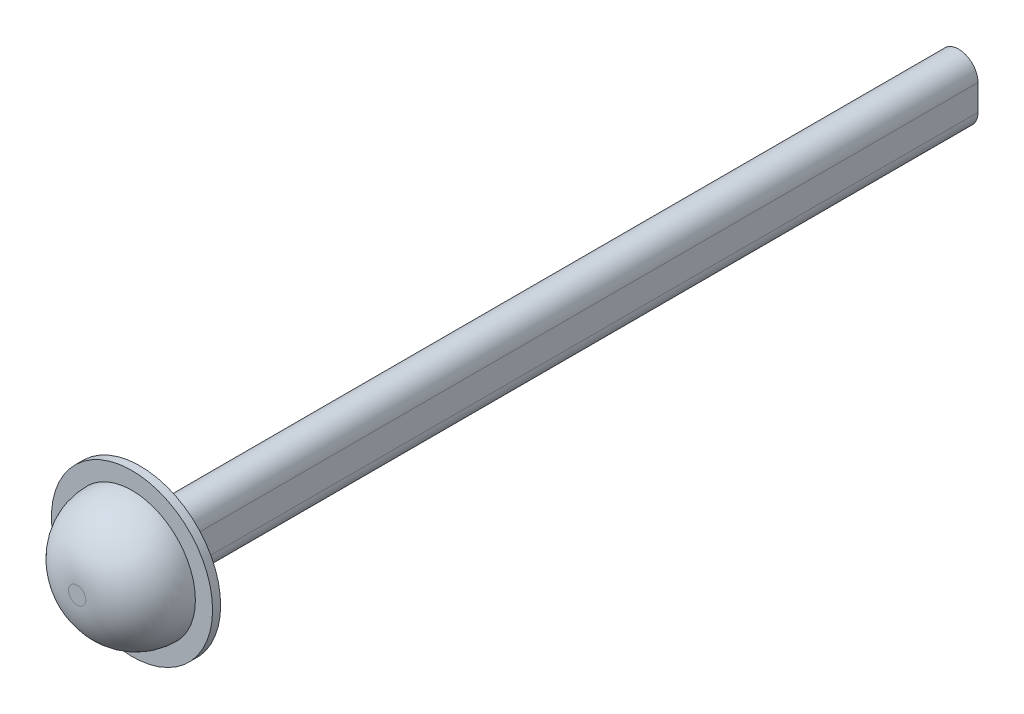
ISO-10303-21;
HEADER;
FILE_DESCRIPTION(('STEP AP214'),'2;1');
FILE_NAME('part.step','',(''),(''),'','','');
FILE_SCHEMA(('AUTOMOTIVE_DESIGN { 1 0 10303 214 1 1 1 1 }'));
ENDSEC;
DATA;
#1=APPLICATION_CONTEXT('core data for automotive mechanical design processes');
#2=APPLICATION_PROTOCOL_DEFINITION('international standard','automotive_design',2000,#1);
#3=PRODUCT_CONTEXT('',#1,'mechanical');
#4=PRODUCT('Part','Part','',(#3));
#5=PRODUCT_RELATED_PRODUCT_CATEGORY('part','',(#4));
#6=PRODUCT_DEFINITION_FORMATION('','',#4);
#7=PRODUCT_DEFINITION_CONTEXT('part definition',#1,'design');
#8=PRODUCT_DEFINITION('design','',#6,#7);
#9=PRODUCT_DEFINITION_SHAPE('','',#8);
#10=(LENGTH_UNIT() NAMED_UNIT(*) SI_UNIT(.MILLI.,.METRE.));
#11=(NAMED_UNIT(*) PLANE_ANGLE_UNIT() SI_UNIT($,.RADIAN.));
#12=(NAMED_UNIT(*) SI_UNIT($,.STERADIAN.) SOLID_ANGLE_UNIT());
#13=UNCERTAINTY_MEASURE_WITH_UNIT(LENGTH_MEASURE(1.E-05),#10,'distance_accuracy_value','');
#14=(GEOMETRIC_REPRESENTATION_CONTEXT(3) GLOBAL_UNCERTAINTY_ASSIGNED_CONTEXT((#13)) GLOBAL_UNIT_ASSIGNED_CONTEXT((#10,
#11,#12)) REPRESENTATION_CONTEXT('',''));
#15=CARTESIAN_POINT('',(0.,0.,0.));
#16=DIRECTION('',(0.,0.,1.));
#17=DIRECTION('',(1.,0.,0.));
#18=AXIS2_PLACEMENT_3D('',#15,#16,#17);
#19=CARTESIAN_POINT('',(0.,4.,254.));
#20=DIRECTION('',(0.,0.,-1.));
#21=DIRECTION('',(-1.,0.,0.));
#22=AXIS2_PLACEMENT_3D('',#19,#20,#21);
#23=CYLINDRICAL_SURFACE('',#22,6.);
#24=DIRECTION('',(0.,0.,-1.));
#25=VECTOR('',#24,1.);
#26=CARTESIAN_POINT('',(-6.,4.,254.));
#27=LINE('',#26,#25);
#28=CARTESIAN_POINT('',(-6.,4.,251.));
#29=VERTEX_POINT('',#28);
#30=CARTESIAN_POINT('',(-6.,4.,0.));
#31=VERTEX_POINT('',#30);
#32=EDGE_CURVE('E91',#29,#31,#27,.T.);
#33=ORIENTED_EDGE('',*,*,#32,.F.);
#34=CARTESIAN_POINT('',(0.,4.,251.));
#35=DIRECTION('',(0.,0.,1.));
#36=DIRECTION('',(1.,0.,0.));
#37=AXIS2_PLACEMENT_3D('',#34,#35,#36);
#38=CIRCLE('',#37,6.);
#39=CARTESIAN_POINT('',(6.,4.,251.));
#40=VERTEX_POINT('',#39);
#41=EDGE_CURVE('E138',#29,#40,#38,.F.);
#42=ORIENTED_EDGE('',*,*,#41,.T.);
#43=DIRECTION('',(0.,0.,-1.));
#44=VECTOR('',#43,1.);
#45=CARTESIAN_POINT('',(6.,4.,254.));
#46=LINE('',#45,#44);
#47=CARTESIAN_POINT('',(6.,4.,0.));
#48=VERTEX_POINT('',#47);
#49=EDGE_CURVE('E111',#40,#48,#46,.T.);
#50=ORIENTED_EDGE('',*,*,#49,.T.);
#51=CARTESIAN_POINT('',(0.,4.,0.));
#52=DIRECTION('',(0.,0.,1.));
#53=DIRECTION('',(1.,0.,0.));
#54=AXIS2_PLACEMENT_3D('',#51,#52,#53);
#55=CIRCLE('',#54,6.);
#56=EDGE_CURVE('E106',#48,#31,#55,.T.);
#57=ORIENTED_EDGE('',*,*,#56,.T.);
#58=EDGE_LOOP('',(#33,#42,#50,#57));
#59=FACE_BOUND('',#58,.T.);
#60=ADVANCED_FACE('F39',(#59),#23,.T.);
#61=CARTESIAN_POINT('',(-6.,4.,254.));
#62=DIRECTION('',(1.,0.,0.));
#63=DIRECTION('',(0.,1.,0.));
#64=AXIS2_PLACEMENT_3D('',#61,#62,#63);
#65=PLANE('',#64);
#66=DIRECTION('',(0.,0.,-1.));
#67=VECTOR('',#66,1.);
#68=CARTESIAN_POINT('',(-6.,-4.,254.));
#69=LINE('',#68,#67);
#70=CARTESIAN_POINT('',(-6.,-4.,251.));
#71=VERTEX_POINT('',#70);
#72=CARTESIAN_POINT('',(-6.,-4.,0.));
#73=VERTEX_POINT('',#72);
#74=EDGE_CURVE('E100',#71,#73,#69,.T.);
#75=ORIENTED_EDGE('',*,*,#74,.F.);
#76=DIRECTION('',(0.,1.,0.));
#77=VECTOR('',#76,1.);
#78=CARTESIAN_POINT('',(-6.,4.,251.));
#79=LINE('',#78,#77);
#80=EDGE_CURVE('E48',#71,#29,#79,.T.);
#81=ORIENTED_EDGE('',*,*,#80,.T.);
#82=ORIENTED_EDGE('',*,*,#32,.T.);
#83=DIRECTION('',(0.,-1.,0.));
#84=VECTOR('',#83,1.);
#85=CARTESIAN_POINT('',(-6.,4.,0.));
#86=LINE('',#85,#84);
#87=EDGE_CURVE('E94',#31,#73,#86,.T.);
#88=ORIENTED_EDGE('',*,*,#87,.T.);
#89=EDGE_LOOP('',(#75,#81,#82,#88));
#90=FACE_BOUND('',#89,.T.);
#91=ADVANCED_FACE('F93',(#90),#65,.F.);
#92=CARTESIAN_POINT('',(0.,-4.,254.));
#93=DIRECTION('',(0.,0.,-1.));
#94=DIRECTION('',(-1.,0.,0.));
#95=AXIS2_PLACEMENT_3D('',#92,#93,#94);
#96=CYLINDRICAL_SURFACE('',#95,6.);
#97=DIRECTION('',(0.,0.,-1.));
#98=VECTOR('',#97,1.);
#99=CARTESIAN_POINT('',(6.,-4.,254.));
#100=LINE('',#99,#98);
#101=CARTESIAN_POINT('',(6.,-4.,251.));
#102=VERTEX_POINT('',#101);
#103=CARTESIAN_POINT('',(6.,-4.,0.));
#104=VERTEX_POINT('',#103);
#105=EDGE_CURVE('E124',#102,#104,#100,.T.);
#106=ORIENTED_EDGE('',*,*,#105,.F.);
#107=CARTESIAN_POINT('',(0.,-4.,251.));
#108=DIRECTION('',(0.,0.,1.));
#109=DIRECTION('',(1.,0.,0.));
#110=AXIS2_PLACEMENT_3D('',#107,#108,#109);
#111=CIRCLE('',#110,6.);
#112=EDGE_CURVE('E55',#102,#71,#111,.F.);
#113=ORIENTED_EDGE('',*,*,#112,.T.);
#114=ORIENTED_EDGE('',*,*,#74,.T.);
#115=CARTESIAN_POINT('',(0.,-4.,0.));
#116=DIRECTION('',(0.,0.,1.));
#117=DIRECTION('',(1.,0.,0.));
#118=AXIS2_PLACEMENT_3D('',#115,#116,#117);
#119=CIRCLE('',#118,6.);
#120=EDGE_CURVE('E108',#73,#104,#119,.T.);
#121=ORIENTED_EDGE('',*,*,#120,.T.);
#122=EDGE_LOOP('',(#106,#113,#114,#121));
#123=FACE_BOUND('',#122,.T.);
#124=ADVANCED_FACE('F178',(#123),#96,.T.);
#125=CARTESIAN_POINT('',(6.,4.,254.));
#126=DIRECTION('',(-1.,0.,0.));
#127=DIRECTION('',(0.,0.,1.));
#128=AXIS2_PLACEMENT_3D('',#125,#126,#127);
#129=PLANE('',#128);
#130=ORIENTED_EDGE('',*,*,#49,.F.);
#131=DIRECTION('',(0.,-1.,0.));
#132=VECTOR('',#131,1.);
#133=CARTESIAN_POINT('',(6.,-4.,251.));
#134=LINE('',#133,#132);
#135=EDGE_CURVE('E135',#40,#102,#134,.T.);
#136=ORIENTED_EDGE('',*,*,#135,.T.);
#137=ORIENTED_EDGE('',*,*,#105,.T.);
#138=DIRECTION('',(0.,1.,0.));
#139=VECTOR('',#138,1.);
#140=CARTESIAN_POINT('',(6.,4.,0.));
#141=LINE('',#140,#139);
#142=EDGE_CURVE('E121',#104,#48,#141,.T.);
#143=ORIENTED_EDGE('',*,*,#142,.T.);
#144=EDGE_LOOP('',(#130,#136,#137,#143));
#145=FACE_BOUND('',#144,.T.);
#146=ADVANCED_FACE('F170',(#145),#129,.F.);
#147=CARTESIAN_POINT('',(0.,4.,0.));
#148=DIRECTION('',(0.,0.,1.));
#149=DIRECTION('',(1.,0.,0.));
#150=AXIS2_PLACEMENT_3D('',#147,#148,#149);
#151=PLANE('',#150);
#152=ORIENTED_EDGE('',*,*,#56,.F.);
#153=ORIENTED_EDGE('',*,*,#142,.F.);
#154=ORIENTED_EDGE('',*,*,#120,.F.);
#155=ORIENTED_EDGE('',*,*,#87,.F.);
#156=EDGE_LOOP('',(#152,#153,#154,#155));
#157=FACE_BOUND('',#156,.T.);
#158=ADVANCED_FACE('F104',(#157),#151,.F.);
#159=CARTESIAN_POINT('',(0.,0.,254.));
#160=DIRECTION('',(0.,0.,1.));
#161=DIRECTION('',(1.,0.,0.));
#162=AXIS2_PLACEMENT_3D('',#159,#160,#161);
#163=PLANE('',#162);
#164=CARTESIAN_POINT('',(0.,-4.,254.));
#165=DIRECTION('',(0.,0.,1.));
#166=DIRECTION('',(1.,0.,0.));
#167=AXIS2_PLACEMENT_3D('',#164,#165,#166);
#168=CIRCLE('',#167,9.00000000000001);
#169=CARTESIAN_POINT('',(-9.00000000000001,-4.,254.));
#170=VERTEX_POINT('',#169);
#171=CARTESIAN_POINT('',(9.00000000000001,-4.,254.));
#172=VERTEX_POINT('',#171);
#173=EDGE_CURVE('E128',#170,#172,#168,.T.);
#174=ORIENTED_EDGE('',*,*,#173,.T.);
#175=DIRECTION('',(0.,1.,0.));
#176=VECTOR('',#175,1.);
#177=CARTESIAN_POINT('',(9.00000000000001,4.,254.));
#178=LINE('',#177,#176);
#179=CARTESIAN_POINT('',(9.00000000000001,4.,254.));
#180=VERTEX_POINT('',#179);
#181=EDGE_CURVE('E132',#172,#180,#178,.T.);
#182=ORIENTED_EDGE('',*,*,#181,.T.);
#183=CARTESIAN_POINT('',(0.,4.,254.));
#184=DIRECTION('',(0.,0.,1.));
#185=DIRECTION('',(1.,0.,0.));
#186=AXIS2_PLACEMENT_3D('',#183,#184,#185);
#187=CIRCLE('',#186,9.00000000000001);
#188=CARTESIAN_POINT('',(-9.00000000000001,4.,254.));
#189=VERTEX_POINT('',#188);
#190=EDGE_CURVE('E130',#180,#189,#187,.T.);
#191=ORIENTED_EDGE('',*,*,#190,.T.);
#192=DIRECTION('',(0.,-1.,0.));
#193=VECTOR('',#192,1.);
#194=CARTESIAN_POINT('',(-9.00000000000001,-4.,254.));
#195=LINE('',#194,#193);
#196=EDGE_CURVE('E99',#189,#170,#195,.T.);
#197=ORIENTED_EDGE('',*,*,#196,.T.);
#198=EDGE_LOOP('',(#174,#182,#191,#197));
#199=FACE_BOUND('',#198,.T.);
#200=CARTESIAN_POINT('',(0.,0.,254.));
#201=DIRECTION('',(0.,0.,1.));
#202=DIRECTION('',(1.,0.,0.));
#203=AXIS2_PLACEMENT_3D('',#200,#201,#202);
#204=CIRCLE('',#203,25.);
#205=CARTESIAN_POINT('',(25.,0.,254.));
#206=VERTEX_POINT('',#205);
#207=EDGE_CURVE('E116',#206,#206,#204,.T.);
#208=ORIENTED_EDGE('',*,*,#207,.F.);
#209=EDGE_LOOP('',(#208));
#210=FACE_BOUND('',#209,.T.);
#211=ADVANCED_FACE('F159',(#199,#210),#163,.F.);
#212=CARTESIAN_POINT('',(0.,0.,256.5));
#213=DIRECTION('',(0.,0.,-1.));
#214=DIRECTION('',(-1.,0.,0.));
#215=AXIS2_PLACEMENT_3D('',#212,#213,#214);
#216=CYLINDRICAL_SURFACE('',#215,25.);
#217=CARTESIAN_POINT('',(0.,0.,256.5));
#218=DIRECTION('',(0.,0.,1.));
#219=DIRECTION('',(1.,0.,0.));
#220=AXIS2_PLACEMENT_3D('',#217,#218,#219);
#221=CIRCLE('',#220,25.);
#222=CARTESIAN_POINT('',(25.,0.,256.5));
#223=VERTEX_POINT('',#222);
#224=EDGE_CURVE('E113',#223,#223,#221,.T.);
#225=ORIENTED_EDGE('',*,*,#224,.F.);
#226=EDGE_LOOP('',(#225));
#227=FACE_BOUND('',#226,.T.);
#228=ORIENTED_EDGE('',*,*,#207,.T.);
#229=EDGE_LOOP('',(#228));
#230=FACE_BOUND('',#229,.T.);
#231=ADVANCED_FACE('F157',(#227,#230),#216,.T.);
#232=CARTESIAN_POINT('',(0.,0.,256.5));
#233=DIRECTION('',(0.,0.,1.));
#234=DIRECTION('',(1.,0.,0.));
#235=AXIS2_PLACEMENT_3D('',#232,#233,#234);
#236=PLANE('',#235);
#237=CARTESIAN_POINT('',(0.,0.,256.5));
#238=DIRECTION('',(0.,0.,1.));
#239=DIRECTION('',(1.,0.,0.));
#240=AXIS2_PLACEMENT_3D('',#237,#238,#239);
#241=CIRCLE('',#240,19.6696403864003);
#242=CARTESIAN_POINT('',(19.6696403864003,0.,256.5));
#243=VERTEX_POINT('',#242);
#244=EDGE_CURVE('E11',#243,#243,#241,.T.);
#245=ORIENTED_EDGE('',*,*,#244,.F.);
#246=EDGE_LOOP('',(#245));
#247=FACE_BOUND('',#246,.T.);
#248=ORIENTED_EDGE('',*,*,#224,.T.);
#249=EDGE_LOOP('',(#248));
#250=FACE_BOUND('',#249,.T.);
#251=ADVANCED_FACE('F167',(#247,#250),#236,.T.);
#252=CARTESIAN_POINT('',(-9.00000000000001,0.,254.));
#253=DIRECTION('',(-0.707106781186547,0.,-0.707106781186548));
#254=DIRECTION('',(0.,1.,0.));
#255=AXIS2_PLACEMENT_3D('',#252,#253,#254);
#256=PLANE('',#255);
#257=DIRECTION('',(-0.707106781186548,0.,0.707106781186547));
#258=VECTOR('',#257,1.);
#259=CARTESIAN_POINT('',(-6.,4.,251.));
#260=LINE('',#259,#258);
#261=EDGE_CURVE('E147',#29,#189,#260,.T.);
#262=ORIENTED_EDGE('',*,*,#261,.F.);
#263=ORIENTED_EDGE('',*,*,#80,.F.);
#264=DIRECTION('',(0.707106781186548,0.,-0.707106781186547));
#265=VECTOR('',#264,1.);
#266=CARTESIAN_POINT('',(-9.00000000000001,-4.,254.));
#267=LINE('',#266,#265);
#268=EDGE_CURVE('E149',#170,#71,#267,.T.);
#269=ORIENTED_EDGE('',*,*,#268,.F.);
#270=ORIENTED_EDGE('',*,*,#196,.F.);
#271=EDGE_LOOP('',(#262,#263,#269,#270));
#272=FACE_BOUND('',#271,.T.);
#273=ADVANCED_FACE('F42',(#272),#256,.T.);
#274=CARTESIAN_POINT('',(0.,-4.,254.));
#275=DIRECTION('',(0.,0.,1.));
#276=DIRECTION('',(1.,0.,0.));
#277=AXIS2_PLACEMENT_3D('',#274,#275,#276);
#278=CONICAL_SURFACE('',#277,9.00000000000001,0.785398163397449);
#279=ORIENTED_EDGE('',*,*,#268,.T.);
#280=ORIENTED_EDGE('',*,*,#112,.F.);
#281=DIRECTION('',(-0.707106781186548,0.,-0.707106781186547));
#282=VECTOR('',#281,1.);
#283=CARTESIAN_POINT('',(9.00000000000001,-4.,254.));
#284=LINE('',#283,#282);
#285=EDGE_CURVE('E144',#172,#102,#284,.T.);
#286=ORIENTED_EDGE('',*,*,#285,.F.);
#287=ORIENTED_EDGE('',*,*,#173,.F.);
#288=EDGE_LOOP('',(#279,#280,#286,#287));
#289=FACE_BOUND('',#288,.T.);
#290=ADVANCED_FACE('F196',(#289),#278,.T.);
#291=CARTESIAN_POINT('',(0.,4.,254.));
#292=DIRECTION('',(0.,0.,1.));
#293=DIRECTION('',(1.,0.,0.));
#294=AXIS2_PLACEMENT_3D('',#291,#292,#293);
#295=CONICAL_SURFACE('',#294,9.00000000000001,0.785398163397449);
#296=ORIENTED_EDGE('',*,*,#261,.T.);
#297=ORIENTED_EDGE('',*,*,#190,.F.);
#298=DIRECTION('',(0.707106781186548,0.,0.707106781186547));
#299=VECTOR('',#298,1.);
#300=CARTESIAN_POINT('',(6.,4.,251.));
#301=LINE('',#300,#299);
#302=EDGE_CURVE('E142',#40,#180,#301,.T.);
#303=ORIENTED_EDGE('',*,*,#302,.F.);
#304=ORIENTED_EDGE('',*,*,#41,.F.);
#305=EDGE_LOOP('',(#296,#297,#303,#304));
#306=FACE_BOUND('',#305,.T.);
#307=ADVANCED_FACE('F190',(#306),#295,.T.);
#308=CARTESIAN_POINT('',(9.00000000000001,0.,254.));
#309=DIRECTION('',(0.707106781186547,0.,-0.707106781186548));
#310=DIRECTION('',(0.,-1.,0.));
#311=AXIS2_PLACEMENT_3D('',#308,#309,#310);
#312=PLANE('',#311);
#313=ORIENTED_EDGE('',*,*,#285,.T.);
#314=ORIENTED_EDGE('',*,*,#135,.F.);
#315=ORIENTED_EDGE('',*,*,#302,.T.);
#316=ORIENTED_EDGE('',*,*,#181,.F.);
#317=EDGE_LOOP('',(#313,#314,#315,#316));
#318=FACE_BOUND('',#317,.T.);
#319=ADVANCED_FACE('F183',(#318),#312,.T.);
#320=CARTESIAN_POINT('',(0.,0.,256.5));
#321=DIRECTION('',(0.,0.,1.));
#322=DIRECTION('',(1.,0.,0.));
#323=AXIS2_PLACEMENT_3D('',#320,#321,#322);
#324=DEGENERATE_TOROIDAL_SURFACE('',#323,2.6696403864003,17.,.T.);
#325=ORIENTED_EDGE('',*,*,#244,.T.);
#326=EDGE_LOOP('',(#325));
#327=FACE_BOUND('',#326,.T.);
#328=CARTESIAN_POINT('',(0.,0.,273.5));
#329=DIRECTION('',(0.,0.,1.));
#330=DIRECTION('',(1.,0.,0.));
#331=AXIS2_PLACEMENT_3D('',#328,#329,#330);
#332=CIRCLE('',#331,2.6696403864003);
#333=CARTESIAN_POINT('',(2.6696403864003,0.,273.5));
#334=VERTEX_POINT('',#333);
#335=EDGE_CURVE('E145',#334,#334,#332,.T.);
#336=ORIENTED_EDGE('',*,*,#335,.F.);
#337=EDGE_LOOP('',(#336));
#338=FACE_BOUND('',#337,.T.);
#339=ADVANCED_FACE('F189',(#327,#338),#324,.T.);
#340=CARTESIAN_POINT('',(0.,-2.6696403864003,273.5));
#341=DIRECTION('',(0.,0.,1.));
#342=DIRECTION('',(1.,0.,0.));
#343=AXIS2_PLACEMENT_3D('',#340,#341,#342);
#344=PLANE('',#343);
#345=ORIENTED_EDGE('',*,*,#335,.T.);
#346=EDGE_LOOP('',(#345));
#347=FACE_BOUND('',#346,.T.);
#348=ADVANCED_FACE('F271',(#347),#344,.T.);
#349=CLOSED_SHELL('',(#60,#91,#124,#146,#158,#211,#231,#251,#273,#290,#307,#319,#339,#348));
#350=MANIFOLD_SOLID_BREP('B2',#349);
#351=ADVANCED_BREP_SHAPE_REPRESENTATION('',(#18,#350),#14);
#352=SHAPE_DEFINITION_REPRESENTATION(#9,#351);
ENDSEC;
END-ISO-10303-21;
